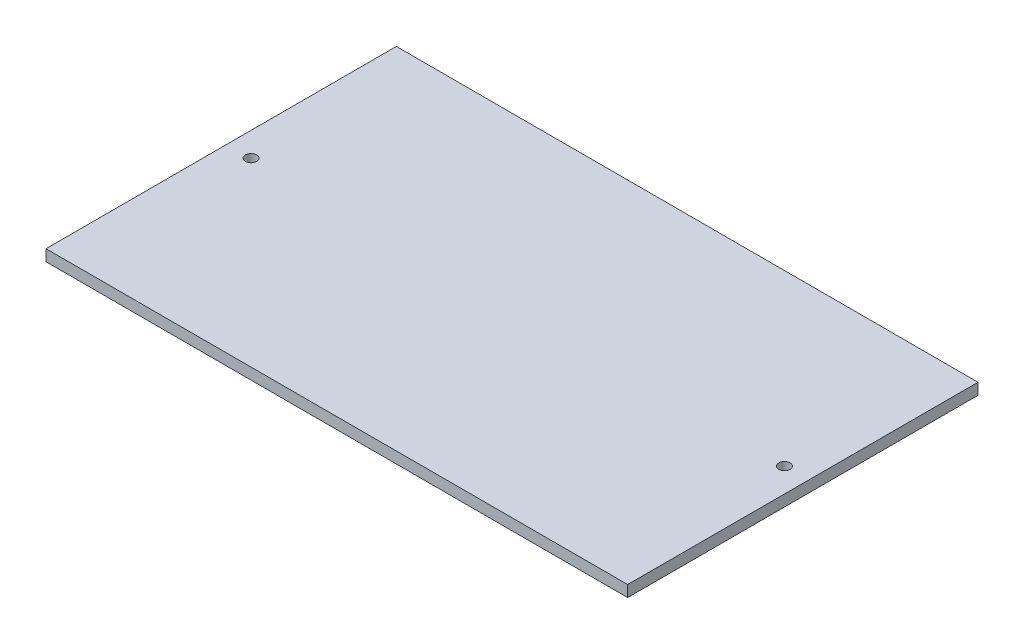
ISO-10303-21;
HEADER;
FILE_DESCRIPTION(('STEP AP214'),'2;1');
FILE_NAME('part.step','',(''),(''),'','','');
FILE_SCHEMA(('AUTOMOTIVE_DESIGN { 1 0 10303 214 1 1 1 1 }'));
ENDSEC;
DATA;
#1=APPLICATION_CONTEXT('core data for automotive mechanical design processes');
#2=APPLICATION_PROTOCOL_DEFINITION('international standard','automotive_design',2000,#1);
#3=PRODUCT_CONTEXT('',#1,'mechanical');
#4=PRODUCT('Part','Part','',(#3));
#5=PRODUCT_RELATED_PRODUCT_CATEGORY('part','',(#4));
#6=PRODUCT_DEFINITION_FORMATION('','',#4);
#7=PRODUCT_DEFINITION_CONTEXT('part definition',#1,'design');
#8=PRODUCT_DEFINITION('design','',#6,#7);
#9=PRODUCT_DEFINITION_SHAPE('','',#8);
#10=(LENGTH_UNIT() NAMED_UNIT(*) SI_UNIT(.MILLI.,.METRE.));
#11=(NAMED_UNIT(*) PLANE_ANGLE_UNIT() SI_UNIT($,.RADIAN.));
#12=(NAMED_UNIT(*) SI_UNIT($,.STERADIAN.) SOLID_ANGLE_UNIT());
#13=UNCERTAINTY_MEASURE_WITH_UNIT(LENGTH_MEASURE(1.E-05),#10,'distance_accuracy_value','');
#14=(GEOMETRIC_REPRESENTATION_CONTEXT(3) GLOBAL_UNCERTAINTY_ASSIGNED_CONTEXT((#13)) GLOBAL_UNIT_ASSIGNED_CONTEXT((#10,
#11,#12)) REPRESENTATION_CONTEXT('',''));
#15=CARTESIAN_POINT('',(0.,0.,0.));
#16=DIRECTION('',(0.,0.,1.));
#17=DIRECTION('',(1.,0.,0.));
#18=AXIS2_PLACEMENT_3D('',#15,#16,#17);
#19=CARTESIAN_POINT('',(0.,2.,0.));
#20=DIRECTION('',(0.,-1.,0.));
#21=DIRECTION('',(0.,0.,-1.));
#22=AXIS2_PLACEMENT_3D('',#19,#20,#21);
#23=PLANE('',#22);
#24=DIRECTION('',(0.,0.,-1.));
#25=VECTOR('',#24,1.);
#26=CARTESIAN_POINT('',(51.5,2.,31.02));
#27=LINE('',#26,#25);
#28=CARTESIAN_POINT('',(51.5,2.,31.02));
#29=VERTEX_POINT('',#28);
#30=CARTESIAN_POINT('',(51.5,2.,-31.02));
#31=VERTEX_POINT('',#30);
#32=EDGE_CURVE('E85',#29,#31,#27,.T.);
#33=ORIENTED_EDGE('',*,*,#32,.T.);
#34=DIRECTION('',(-1.,0.,0.));
#35=VECTOR('',#34,1.);
#36=CARTESIAN_POINT('',(-51.5,2.,-31.02));
#37=LINE('',#36,#35);
#38=CARTESIAN_POINT('',(-51.5,2.,-31.02));
#39=VERTEX_POINT('',#38);
#40=EDGE_CURVE('E80',#31,#39,#37,.T.);
#41=ORIENTED_EDGE('',*,*,#40,.T.);
#42=DIRECTION('',(0.,0.,1.));
#43=VECTOR('',#42,1.);
#44=CARTESIAN_POINT('',(-51.5,2.,31.02));
#45=LINE('',#44,#43);
#46=CARTESIAN_POINT('',(-51.5,2.,31.02));
#47=VERTEX_POINT('',#46);
#48=EDGE_CURVE('E83',#39,#47,#45,.T.);
#49=ORIENTED_EDGE('',*,*,#48,.T.);
#50=DIRECTION('',(1.,0.,0.));
#51=VECTOR('',#50,1.);
#52=CARTESIAN_POINT('',(-51.5,2.,31.02));
#53=LINE('',#52,#51);
#54=EDGE_CURVE('E50',#47,#29,#53,.T.);
#55=ORIENTED_EDGE('',*,*,#54,.T.);
#56=EDGE_LOOP('',(#33,#41,#49,#55));
#57=FACE_BOUND('',#56,.T.);
#58=CARTESIAN_POINT('',(47.23,2.,-1.02));
#59=DIRECTION('',(0.,1.,0.));
#60=DIRECTION('',(0.,0.,1.));
#61=AXIS2_PLACEMENT_3D('',#58,#59,#60);
#62=CIRCLE('',#61,0.999999999999998);
#63=CARTESIAN_POINT('',(47.23,2.,-0.020000000000002));
#64=VERTEX_POINT('',#63);
#65=EDGE_CURVE('E100',#64,#64,#62,.T.);
#66=ORIENTED_EDGE('',*,*,#65,.F.);
#67=EDGE_LOOP('',(#66));
#68=FACE_BOUND('',#67,.T.);
#69=CARTESIAN_POINT('',(-47.23,2.,-1.02));
#70=DIRECTION('',(0.,1.,0.));
#71=DIRECTION('',(0.,0.,1.));
#72=AXIS2_PLACEMENT_3D('',#69,#70,#71);
#73=CIRCLE('',#72,0.999999999999998);
#74=CARTESIAN_POINT('',(-47.23,2.,-0.020000000000002));
#75=VERTEX_POINT('',#74);
#76=EDGE_CURVE('E115',#75,#75,#73,.T.);
#77=ORIENTED_EDGE('',*,*,#76,.F.);
#78=EDGE_LOOP('',(#77));
#79=FACE_BOUND('',#78,.T.);
#80=ADVANCED_FACE('F33',(#57,#68,#79),#23,.F.);
#81=CARTESIAN_POINT('',(0.,0.,0.));
#82=DIRECTION('',(0.,-1.,0.));
#83=DIRECTION('',(0.,0.,-1.));
#84=AXIS2_PLACEMENT_3D('',#81,#82,#83);
#85=PLANE('',#84);
#86=CARTESIAN_POINT('',(47.23,0.,-1.02));
#87=DIRECTION('',(0.,1.,0.));
#88=DIRECTION('',(0.,0.,1.));
#89=AXIS2_PLACEMENT_3D('',#86,#87,#88);
#90=CIRCLE('',#89,0.999999999999998);
#91=CARTESIAN_POINT('',(47.23,0.,-0.020000000000002));
#92=VERTEX_POINT('',#91);
#93=EDGE_CURVE('E112',#92,#92,#90,.T.);
#94=ORIENTED_EDGE('',*,*,#93,.T.);
#95=EDGE_LOOP('',(#94));
#96=FACE_BOUND('',#95,.T.);
#97=DIRECTION('',(0.,0.,-1.));
#98=VECTOR('',#97,1.);
#99=CARTESIAN_POINT('',(51.5,0.,31.02));
#100=LINE('',#99,#98);
#101=CARTESIAN_POINT('',(51.5,0.,31.02));
#102=VERTEX_POINT('',#101);
#103=CARTESIAN_POINT('',(51.5,0.,-31.02));
#104=VERTEX_POINT('',#103);
#105=EDGE_CURVE('E97',#102,#104,#100,.T.);
#106=ORIENTED_EDGE('',*,*,#105,.F.);
#107=DIRECTION('',(1.,0.,0.));
#108=VECTOR('',#107,1.);
#109=CARTESIAN_POINT('',(-51.5,0.,31.02));
#110=LINE('',#109,#108);
#111=CARTESIAN_POINT('',(-51.5,0.,31.02));
#112=VERTEX_POINT('',#111);
#113=EDGE_CURVE('E73',#112,#102,#110,.T.);
#114=ORIENTED_EDGE('',*,*,#113,.F.);
#115=DIRECTION('',(0.,0.,1.));
#116=VECTOR('',#115,1.);
#117=CARTESIAN_POINT('',(-51.5,0.,31.02));
#118=LINE('',#117,#116);
#119=CARTESIAN_POINT('',(-51.5,0.,-31.02));
#120=VERTEX_POINT('',#119);
#121=EDGE_CURVE('E67',#120,#112,#118,.T.);
#122=ORIENTED_EDGE('',*,*,#121,.F.);
#123=DIRECTION('',(-1.,0.,0.));
#124=VECTOR('',#123,1.);
#125=CARTESIAN_POINT('',(-51.5,0.,-31.02));
#126=LINE('',#125,#124);
#127=EDGE_CURVE('E89',#104,#120,#126,.T.);
#128=ORIENTED_EDGE('',*,*,#127,.F.);
#129=EDGE_LOOP('',(#106,#114,#122,#128));
#130=FACE_BOUND('',#129,.T.);
#131=CARTESIAN_POINT('',(-47.23,0.,-1.02));
#132=DIRECTION('',(0.,1.,0.));
#133=DIRECTION('',(0.,0.,1.));
#134=AXIS2_PLACEMENT_3D('',#131,#132,#133);
#135=CIRCLE('',#134,0.999999999999998);
#136=CARTESIAN_POINT('',(-47.23,0.,-0.020000000000002));
#137=VERTEX_POINT('',#136);
#138=EDGE_CURVE('E118',#137,#137,#135,.T.);
#139=ORIENTED_EDGE('',*,*,#138,.T.);
#140=EDGE_LOOP('',(#139));
#141=FACE_BOUND('',#140,.T.);
#142=ADVANCED_FACE('F108',(#96,#130,#141),#85,.T.);
#143=CARTESIAN_POINT('',(51.5,2.,31.02));
#144=DIRECTION('',(-1.,0.,0.));
#145=DIRECTION('',(0.,0.,1.));
#146=AXIS2_PLACEMENT_3D('',#143,#144,#145);
#147=PLANE('',#146);
#148=ORIENTED_EDGE('',*,*,#105,.T.);
#149=DIRECTION('',(0.,-1.,0.));
#150=VECTOR('',#149,1.);
#151=CARTESIAN_POINT('',(51.5,2.,-31.02));
#152=LINE('',#151,#150);
#153=EDGE_CURVE('E11',#31,#104,#152,.T.);
#154=ORIENTED_EDGE('',*,*,#153,.F.);
#155=ORIENTED_EDGE('',*,*,#32,.F.);
#156=DIRECTION('',(0.,-1.,0.));
#157=VECTOR('',#156,1.);
#158=CARTESIAN_POINT('',(51.5,2.,31.02));
#159=LINE('',#158,#157);
#160=EDGE_CURVE('E93',#29,#102,#159,.T.);
#161=ORIENTED_EDGE('',*,*,#160,.T.);
#162=EDGE_LOOP('',(#148,#154,#155,#161));
#163=FACE_BOUND('',#162,.T.);
#164=ADVANCED_FACE('F35',(#163),#147,.F.);
#165=CARTESIAN_POINT('',(-51.5,2.,-31.02));
#166=DIRECTION('',(0.,0.,1.));
#167=DIRECTION('',(1.,0.,0.));
#168=AXIS2_PLACEMENT_3D('',#165,#166,#167);
#169=PLANE('',#168);
#170=ORIENTED_EDGE('',*,*,#127,.T.);
#171=DIRECTION('',(0.,-1.,0.));
#172=VECTOR('',#171,1.);
#173=CARTESIAN_POINT('',(-51.5,2.,-31.02));
#174=LINE('',#173,#172);
#175=EDGE_CURVE('E42',#39,#120,#174,.T.);
#176=ORIENTED_EDGE('',*,*,#175,.F.);
#177=ORIENTED_EDGE('',*,*,#40,.F.);
#178=ORIENTED_EDGE('',*,*,#153,.T.);
#179=EDGE_LOOP('',(#170,#176,#177,#178));
#180=FACE_BOUND('',#179,.T.);
#181=ADVANCED_FACE('F88',(#180),#169,.F.);
#182=CARTESIAN_POINT('',(-51.5,2.,31.02));
#183=DIRECTION('',(1.,0.,0.));
#184=DIRECTION('',(0.,0.,-1.));
#185=AXIS2_PLACEMENT_3D('',#182,#183,#184);
#186=PLANE('',#185);
#187=ORIENTED_EDGE('',*,*,#121,.T.);
#188=DIRECTION('',(0.,-1.,0.));
#189=VECTOR('',#188,1.);
#190=CARTESIAN_POINT('',(-51.5,2.,31.02));
#191=LINE('',#190,#189);
#192=EDGE_CURVE('E90',#47,#112,#191,.T.);
#193=ORIENTED_EDGE('',*,*,#192,.F.);
#194=ORIENTED_EDGE('',*,*,#48,.F.);
#195=ORIENTED_EDGE('',*,*,#175,.T.);
#196=EDGE_LOOP('',(#187,#193,#194,#195));
#197=FACE_BOUND('',#196,.T.);
#198=ADVANCED_FACE('F91',(#197),#186,.F.);
#199=CARTESIAN_POINT('',(-51.5,2.,31.02));
#200=DIRECTION('',(0.,0.,-1.));
#201=DIRECTION('',(-1.,0.,0.));
#202=AXIS2_PLACEMENT_3D('',#199,#200,#201);
#203=PLANE('',#202);
#204=ORIENTED_EDGE('',*,*,#113,.T.);
#205=ORIENTED_EDGE('',*,*,#160,.F.);
#206=ORIENTED_EDGE('',*,*,#54,.F.);
#207=ORIENTED_EDGE('',*,*,#192,.T.);
#208=EDGE_LOOP('',(#204,#205,#206,#207));
#209=FACE_BOUND('',#208,.T.);
#210=ADVANCED_FACE('F105',(#209),#203,.F.);
#211=CARTESIAN_POINT('',(47.23,2.,-1.02));
#212=DIRECTION('',(0.,-1.,0.));
#213=DIRECTION('',(0.,0.,-1.));
#214=AXIS2_PLACEMENT_3D('',#211,#212,#213);
#215=CYLINDRICAL_SURFACE('',#214,0.999999999999998);
#216=ORIENTED_EDGE('',*,*,#65,.T.);
#217=EDGE_LOOP('',(#216));
#218=FACE_BOUND('',#217,.T.);
#219=ORIENTED_EDGE('',*,*,#93,.F.);
#220=EDGE_LOOP('',(#219));
#221=FACE_BOUND('',#220,.T.);
#222=ADVANCED_FACE('F135',(#218,#221),#215,.F.);
#223=CARTESIAN_POINT('',(-47.23,2.,-1.02));
#224=DIRECTION('',(0.,-1.,0.));
#225=DIRECTION('',(0.,0.,-1.));
#226=AXIS2_PLACEMENT_3D('',#223,#224,#225);
#227=CYLINDRICAL_SURFACE('',#226,0.999999999999998);
#228=ORIENTED_EDGE('',*,*,#76,.T.);
#229=EDGE_LOOP('',(#228));
#230=FACE_BOUND('',#229,.T.);
#231=ORIENTED_EDGE('',*,*,#138,.F.);
#232=EDGE_LOOP('',(#231));
#233=FACE_BOUND('',#232,.T.);
#234=ADVANCED_FACE('F124',(#230,#233),#227,.F.);
#235=CLOSED_SHELL('',(#80,#142,#164,#181,#198,#210,#222,#234));
#236=MANIFOLD_SOLID_BREP('B2',#235);
#237=ADVANCED_BREP_SHAPE_REPRESENTATION('',(#18,#236),#14);
#238=SHAPE_DEFINITION_REPRESENTATION(#9,#237);
ENDSEC;
END-ISO-10303-21;
